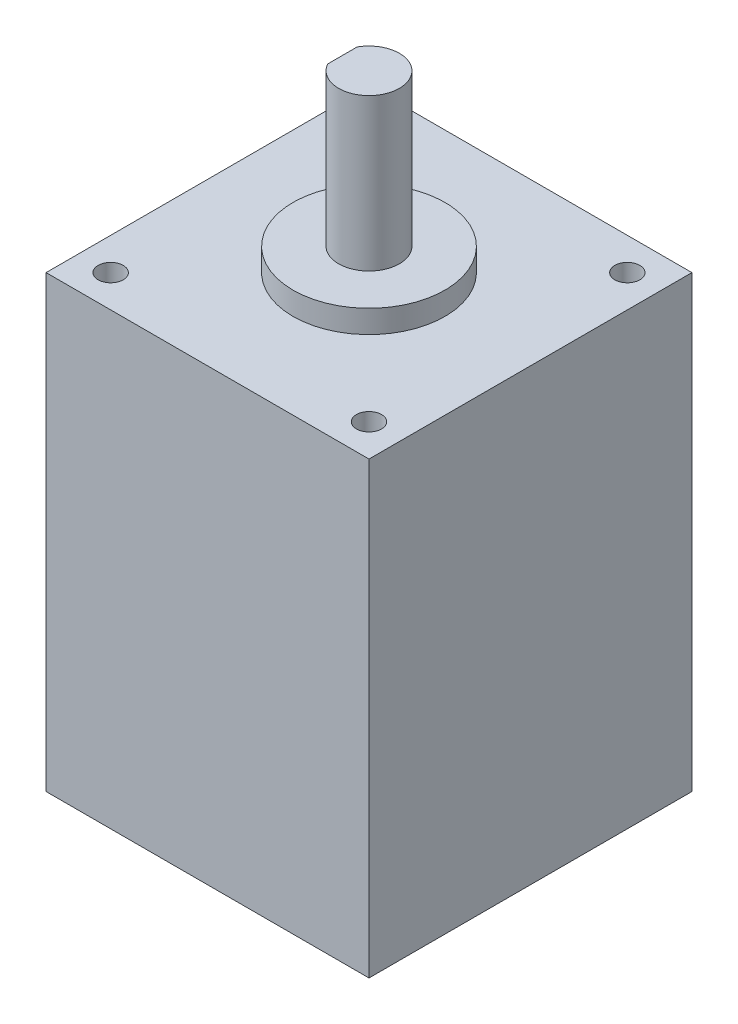
ISO-10303-21;
HEADER;
FILE_DESCRIPTION(('STEP AP214'),'2;1');
FILE_NAME('part.step','',(''),(''),'','','');
FILE_SCHEMA(('AUTOMOTIVE_DESIGN { 1 0 10303 214 1 1 1 1 }'));
ENDSEC;
DATA;
#1=APPLICATION_CONTEXT('core data for automotive mechanical design processes');
#2=APPLICATION_PROTOCOL_DEFINITION('international standard','automotive_design',2000,#1);
#3=PRODUCT_CONTEXT('',#1,'mechanical');
#4=PRODUCT('Part','Part','',(#3));
#5=PRODUCT_RELATED_PRODUCT_CATEGORY('part','',(#4));
#6=PRODUCT_DEFINITION_FORMATION('','',#4);
#7=PRODUCT_DEFINITION_CONTEXT('part definition',#1,'design');
#8=PRODUCT_DEFINITION('design','',#6,#7);
#9=PRODUCT_DEFINITION_SHAPE('','',#8);
#10=(LENGTH_UNIT() NAMED_UNIT(*) SI_UNIT(.MILLI.,.METRE.));
#11=(NAMED_UNIT(*) PLANE_ANGLE_UNIT() SI_UNIT($,.RADIAN.));
#12=(NAMED_UNIT(*) SI_UNIT($,.STERADIAN.) SOLID_ANGLE_UNIT());
#13=UNCERTAINTY_MEASURE_WITH_UNIT(LENGTH_MEASURE(1.E-05),#10,'distance_accuracy_value','');
#14=(GEOMETRIC_REPRESENTATION_CONTEXT(3) GLOBAL_UNCERTAINTY_ASSIGNED_CONTEXT((#13)) GLOBAL_UNIT_ASSIGNED_CONTEXT((#10,
#11,#12)) REPRESENTATION_CONTEXT('',''));
#15=CARTESIAN_POINT('',(0.,0.,0.));
#16=DIRECTION('',(0.,0.,1.));
#17=DIRECTION('',(1.,0.,0.));
#18=AXIS2_PLACEMENT_3D('',#15,#16,#17);
#19=CARTESIAN_POINT('',(0.,59.15,-42.5));
#20=DIRECTION('',(-1.,0.,0.));
#21=DIRECTION('',(0.,0.,1.));
#22=AXIS2_PLACEMENT_3D('',#19,#20,#21);
#23=PLANE('',#22);
#24=DIRECTION('',(0.,0.,-1.));
#25=VECTOR('',#24,1.);
#26=CARTESIAN_POINT('',(0.,0.,-42.5));
#27=LINE('',#26,#25);
#28=CARTESIAN_POINT('',(0.,0.,0.));
#29=VERTEX_POINT('',#28);
#30=CARTESIAN_POINT('',(0.,0.,-42.5));
#31=VERTEX_POINT('',#30);
#32=EDGE_CURVE('E164',#29,#31,#27,.T.);
#33=ORIENTED_EDGE('',*,*,#32,.T.);
#34=DIRECTION('',(0.,-1.,0.));
#35=VECTOR('',#34,1.);
#36=CARTESIAN_POINT('',(0.,59.15,-42.5));
#37=LINE('',#36,#35);
#38=CARTESIAN_POINT('',(0.,59.15,-42.5));
#39=VERTEX_POINT('',#38);
#40=EDGE_CURVE('E43',#39,#31,#37,.T.);
#41=ORIENTED_EDGE('',*,*,#40,.F.);
#42=DIRECTION('',(0.,0.,-1.));
#43=VECTOR('',#42,1.);
#44=CARTESIAN_POINT('',(0.,59.15,-42.5));
#45=LINE('',#44,#43);
#46=CARTESIAN_POINT('',(0.,59.15,0.));
#47=VERTEX_POINT('',#46);
#48=EDGE_CURVE('E167',#47,#39,#45,.T.);
#49=ORIENTED_EDGE('',*,*,#48,.F.);
#50=DIRECTION('',(0.,-1.,0.));
#51=VECTOR('',#50,1.);
#52=CARTESIAN_POINT('',(0.,59.15,0.));
#53=LINE('',#52,#51);
#54=EDGE_CURVE('E173',#47,#29,#53,.T.);
#55=ORIENTED_EDGE('',*,*,#54,.T.);
#56=EDGE_LOOP('',(#33,#41,#49,#55));
#57=FACE_BOUND('',#56,.T.);
#58=ADVANCED_FACE('F40',(#57),#23,.F.);
#59=CARTESIAN_POINT('',(-42.5,59.15,-42.5));
#60=DIRECTION('',(0.,0.,1.));
#61=DIRECTION('',(1.,0.,0.));
#62=AXIS2_PLACEMENT_3D('',#59,#60,#61);
#63=PLANE('',#62);
#64=DIRECTION('',(-1.,0.,0.));
#65=VECTOR('',#64,1.);
#66=CARTESIAN_POINT('',(-42.5,0.,-42.5));
#67=LINE('',#66,#65);
#68=CARTESIAN_POINT('',(-42.5,0.,-42.5));
#69=VERTEX_POINT('',#68);
#70=EDGE_CURVE('E176',#31,#69,#67,.T.);
#71=ORIENTED_EDGE('',*,*,#70,.T.);
#72=DIRECTION('',(0.,-1.,0.));
#73=VECTOR('',#72,1.);
#74=CARTESIAN_POINT('',(-42.5,59.15,-42.5));
#75=LINE('',#74,#73);
#76=CARTESIAN_POINT('',(-42.5,59.15,-42.5));
#77=VERTEX_POINT('',#76);
#78=EDGE_CURVE('E183',#77,#69,#75,.T.);
#79=ORIENTED_EDGE('',*,*,#78,.F.);
#80=DIRECTION('',(-1.,0.,0.));
#81=VECTOR('',#80,1.);
#82=CARTESIAN_POINT('',(-42.5,59.15,-42.5));
#83=LINE('',#82,#81);
#84=EDGE_CURVE('E94',#39,#77,#83,.T.);
#85=ORIENTED_EDGE('',*,*,#84,.F.);
#86=ORIENTED_EDGE('',*,*,#40,.T.);
#87=EDGE_LOOP('',(#71,#79,#85,#86));
#88=FACE_BOUND('',#87,.T.);
#89=ADVANCED_FACE('F189',(#88),#63,.F.);
#90=CARTESIAN_POINT('',(-42.5,59.15,0.));
#91=DIRECTION('',(1.,0.,0.));
#92=DIRECTION('',(0.,0.,-1.));
#93=AXIS2_PLACEMENT_3D('',#90,#91,#92);
#94=PLANE('',#93);
#95=DIRECTION('',(0.,0.,1.));
#96=VECTOR('',#95,1.);
#97=CARTESIAN_POINT('',(-42.5,0.,0.));
#98=LINE('',#97,#96);
#99=CARTESIAN_POINT('',(-42.5,0.,0.));
#100=VERTEX_POINT('',#99);
#101=EDGE_CURVE('E178',#69,#100,#98,.T.);
#102=ORIENTED_EDGE('',*,*,#101,.T.);
#103=DIRECTION('',(0.,-1.,0.));
#104=VECTOR('',#103,1.);
#105=CARTESIAN_POINT('',(-42.5,59.15,0.));
#106=LINE('',#105,#104);
#107=CARTESIAN_POINT('',(-42.5,59.15,0.));
#108=VERTEX_POINT('',#107);
#109=EDGE_CURVE('E182',#108,#100,#106,.T.);
#110=ORIENTED_EDGE('',*,*,#109,.F.);
#111=DIRECTION('',(0.,0.,1.));
#112=VECTOR('',#111,1.);
#113=CARTESIAN_POINT('',(-42.5,59.15,0.));
#114=LINE('',#113,#112);
#115=EDGE_CURVE('E170',#77,#108,#114,.T.);
#116=ORIENTED_EDGE('',*,*,#115,.F.);
#117=ORIENTED_EDGE('',*,*,#78,.T.);
#118=EDGE_LOOP('',(#102,#110,#116,#117));
#119=FACE_BOUND('',#118,.T.);
#120=ADVANCED_FACE('F196',(#119),#94,.F.);
#121=CARTESIAN_POINT('',(0.,59.15,0.));
#122=DIRECTION('',(0.,0.,-1.));
#123=DIRECTION('',(-1.,0.,0.));
#124=AXIS2_PLACEMENT_3D('',#121,#122,#123);
#125=PLANE('',#124);
#126=DIRECTION('',(1.,0.,0.));
#127=VECTOR('',#126,1.);
#128=CARTESIAN_POINT('',(0.,0.,0.));
#129=LINE('',#128,#127);
#130=EDGE_CURVE('E86',#100,#29,#129,.T.);
#131=ORIENTED_EDGE('',*,*,#130,.T.);
#132=ORIENTED_EDGE('',*,*,#54,.F.);
#133=DIRECTION('',(1.,0.,0.));
#134=VECTOR('',#133,1.);
#135=CARTESIAN_POINT('',(0.,59.15,0.));
#136=LINE('',#135,#134);
#137=EDGE_CURVE('E65',#108,#47,#136,.T.);
#138=ORIENTED_EDGE('',*,*,#137,.F.);
#139=ORIENTED_EDGE('',*,*,#109,.T.);
#140=EDGE_LOOP('',(#131,#132,#138,#139));
#141=FACE_BOUND('',#140,.T.);
#142=ADVANCED_FACE('F197',(#141),#125,.F.);
#143=CARTESIAN_POINT('',(0.,59.15,0.));
#144=DIRECTION('',(0.,-1.,0.));
#145=DIRECTION('',(0.,0.,-1.));
#146=AXIS2_PLACEMENT_3D('',#143,#144,#145);
#147=PLANE('',#146);
#148=CARTESIAN_POINT('',(-4.25,59.15,-38.25));
#149=DIRECTION('',(0.,1.,0.));
#150=DIRECTION('',(0.,0.,1.));
#151=AXIS2_PLACEMENT_3D('',#148,#149,#150);
#152=CIRCLE('',#151,1.65);
#153=CARTESIAN_POINT('',(-4.25,59.15,-36.6));
#154=VERTEX_POINT('',#153);
#155=EDGE_CURVE('E133',#154,#154,#152,.T.);
#156=ORIENTED_EDGE('',*,*,#155,.F.);
#157=EDGE_LOOP('',(#156));
#158=FACE_BOUND('',#157,.T.);
#159=CARTESIAN_POINT('',(-4.25,59.15,-4.25));
#160=DIRECTION('',(0.,1.,0.));
#161=DIRECTION('',(0.,0.,1.));
#162=AXIS2_PLACEMENT_3D('',#159,#160,#161);
#163=CIRCLE('',#162,1.65);
#164=CARTESIAN_POINT('',(-4.25,59.15,-2.6));
#165=VERTEX_POINT('',#164);
#166=EDGE_CURVE('E142',#165,#165,#163,.T.);
#167=ORIENTED_EDGE('',*,*,#166,.F.);
#168=EDGE_LOOP('',(#167));
#169=FACE_BOUND('',#168,.T.);
#170=CARTESIAN_POINT('',(-38.25,59.15,-4.25));
#171=DIRECTION('',(0.,1.,0.));
#172=DIRECTION('',(0.,0.,1.));
#173=AXIS2_PLACEMENT_3D('',#170,#171,#172);
#174=CIRCLE('',#173,1.65);
#175=CARTESIAN_POINT('',(-38.25,59.15,-2.6));
#176=VERTEX_POINT('',#175);
#177=EDGE_CURVE('E148',#176,#176,#174,.T.);
#178=ORIENTED_EDGE('',*,*,#177,.F.);
#179=EDGE_LOOP('',(#178));
#180=FACE_BOUND('',#179,.T.);
#181=CARTESIAN_POINT('',(-38.25,59.15,-38.25));
#182=DIRECTION('',(0.,1.,0.));
#183=DIRECTION('',(0.,0.,1.));
#184=AXIS2_PLACEMENT_3D('',#181,#182,#183);
#185=CIRCLE('',#184,1.65);
#186=CARTESIAN_POINT('',(-38.25,59.15,-36.6));
#187=VERTEX_POINT('',#186);
#188=EDGE_CURVE('E154',#187,#187,#185,.T.);
#189=ORIENTED_EDGE('',*,*,#188,.F.);
#190=EDGE_LOOP('',(#189));
#191=FACE_BOUND('',#190,.T.);
#192=CARTESIAN_POINT('',(-21.25,59.15,-21.25));
#193=DIRECTION('',(0.,1.,0.));
#194=DIRECTION('',(0.,0.,1.));
#195=AXIS2_PLACEMENT_3D('',#192,#193,#194);
#196=CIRCLE('',#195,10.);
#197=CARTESIAN_POINT('',(-21.25,59.15,-11.25));
#198=VERTEX_POINT('',#197);
#199=EDGE_CURVE('E48',#198,#198,#196,.T.);
#200=ORIENTED_EDGE('',*,*,#199,.F.);
#201=EDGE_LOOP('',(#200));
#202=FACE_BOUND('',#201,.T.);
#203=ORIENTED_EDGE('',*,*,#48,.T.);
#204=ORIENTED_EDGE('',*,*,#84,.T.);
#205=ORIENTED_EDGE('',*,*,#115,.T.);
#206=ORIENTED_EDGE('',*,*,#137,.T.);
#207=EDGE_LOOP('',(#203,#204,#205,#206));
#208=FACE_BOUND('',#207,.T.);
#209=ADVANCED_FACE('F198',(#158,#169,#180,#191,#202,#208),#147,.F.);
#210=CARTESIAN_POINT('',(0.,0.,0.));
#211=DIRECTION('',(0.,-1.,0.));
#212=DIRECTION('',(0.,0.,-1.));
#213=AXIS2_PLACEMENT_3D('',#210,#211,#212);
#214=PLANE('',#213);
#215=ORIENTED_EDGE('',*,*,#32,.F.);
#216=ORIENTED_EDGE('',*,*,#130,.F.);
#217=ORIENTED_EDGE('',*,*,#101,.F.);
#218=ORIENTED_EDGE('',*,*,#70,.F.);
#219=EDGE_LOOP('',(#215,#216,#217,#218));
#220=FACE_BOUND('',#219,.T.);
#221=ADVANCED_FACE('F194',(#220),#214,.T.);
#222=CARTESIAN_POINT('',(-21.25,62.15,-21.25));
#223=DIRECTION('',(0.,-1.,0.));
#224=DIRECTION('',(0.,0.,-1.));
#225=AXIS2_PLACEMENT_3D('',#222,#223,#224);
#226=CYLINDRICAL_SURFACE('',#225,10.);
#227=CARTESIAN_POINT('',(-21.25,62.15,-21.25));
#228=DIRECTION('',(0.,1.,0.));
#229=DIRECTION('',(0.,0.,1.));
#230=AXIS2_PLACEMENT_3D('',#227,#228,#229);
#231=CIRCLE('',#230,10.);
#232=CARTESIAN_POINT('',(-21.25,62.15,-11.25));
#233=VERTEX_POINT('',#232);
#234=EDGE_CURVE('E160',#233,#233,#231,.T.);
#235=ORIENTED_EDGE('',*,*,#234,.F.);
#236=EDGE_LOOP('',(#235));
#237=FACE_BOUND('',#236,.T.);
#238=ORIENTED_EDGE('',*,*,#199,.T.);
#239=EDGE_LOOP('',(#238));
#240=FACE_BOUND('',#239,.T.);
#241=ADVANCED_FACE('F206',(#237,#240),#226,.T.);
#242=CARTESIAN_POINT('',(-21.25,62.15,-21.25));
#243=DIRECTION('',(0.,1.,0.));
#244=DIRECTION('',(0.,0.,1.));
#245=AXIS2_PLACEMENT_3D('',#242,#243,#244);
#246=PLANE('',#245);
#247=CARTESIAN_POINT('',(-21.25,62.15,-21.25));
#248=DIRECTION('',(0.,1.,0.));
#249=DIRECTION('',(0.,0.,1.));
#250=AXIS2_PLACEMENT_3D('',#247,#248,#249);
#251=CIRCLE('',#250,4.);
#252=CARTESIAN_POINT('',(-21.25,62.15,-17.25));
#253=VERTEX_POINT('',#252);
#254=EDGE_CURVE('E11',#253,#253,#251,.T.);
#255=ORIENTED_EDGE('',*,*,#254,.F.);
#256=EDGE_LOOP('',(#255));
#257=FACE_BOUND('',#256,.T.);
#258=ORIENTED_EDGE('',*,*,#234,.T.);
#259=EDGE_LOOP('',(#258));
#260=FACE_BOUND('',#259,.T.);
#261=ADVANCED_FACE('F242',(#257,#260),#246,.T.);
#262=CARTESIAN_POINT('',(-21.25,82.15,-21.25));
#263=DIRECTION('',(0.,-1.,0.));
#264=DIRECTION('',(0.,0.,-1.));
#265=AXIS2_PLACEMENT_3D('',#262,#263,#264);
#266=CYLINDRICAL_SURFACE('',#265,4.);
#267=CARTESIAN_POINT('',(-21.25,82.15,-21.25));
#268=DIRECTION('',(0.,1.,0.));
#269=DIRECTION('',(0.,0.,1.));
#270=AXIS2_PLACEMENT_3D('',#267,#268,#269);
#271=CIRCLE('',#270,4.);
#272=CARTESIAN_POINT('',(-24.75,82.15,-19.3135083268963));
#273=VERTEX_POINT('',#272);
#274=CARTESIAN_POINT('',(-24.75,82.15,-23.1864916731037));
#275=VERTEX_POINT('',#274);
#276=EDGE_CURVE('E131',#273,#275,#271,.T.);
#277=ORIENTED_EDGE('',*,*,#276,.F.);
#278=DIRECTION('',(0.,1.,0.));
#279=VECTOR('',#278,1.);
#280=CARTESIAN_POINT('',(-24.75,70.15,-19.3135083268963));
#281=LINE('',#280,#279);
#282=CARTESIAN_POINT('',(-24.75,70.15,-19.3135083268963));
#283=VERTEX_POINT('',#282);
#284=EDGE_CURVE('E56',#283,#273,#281,.T.);
#285=ORIENTED_EDGE('',*,*,#284,.F.);
#286=CARTESIAN_POINT('',(-21.25,70.15,-21.25));
#287=DIRECTION('',(0.,1.,0.));
#288=DIRECTION('',(0.,0.,1.));
#289=AXIS2_PLACEMENT_3D('',#286,#287,#288);
#290=CIRCLE('',#289,4.);
#291=CARTESIAN_POINT('',(-24.75,70.15,-23.1864916731037));
#292=VERTEX_POINT('',#291);
#293=EDGE_CURVE('E117',#292,#283,#290,.T.);
#294=ORIENTED_EDGE('',*,*,#293,.F.);
#295=DIRECTION('',(0.,1.,0.));
#296=VECTOR('',#295,1.);
#297=CARTESIAN_POINT('',(-24.75,70.15,-23.1864916731037));
#298=LINE('',#297,#296);
#299=EDGE_CURVE('E125',#292,#275,#298,.T.);
#300=ORIENTED_EDGE('',*,*,#299,.T.);
#301=EDGE_LOOP('',(#277,#285,#294,#300));
#302=FACE_BOUND('',#301,.T.);
#303=ORIENTED_EDGE('',*,*,#254,.T.);
#304=EDGE_LOOP('',(#303));
#305=FACE_BOUND('',#304,.T.);
#306=ADVANCED_FACE('F128',(#302,#305),#266,.T.);
#307=CARTESIAN_POINT('',(-21.25,82.15,-21.25));
#308=DIRECTION('',(0.,1.,0.));
#309=DIRECTION('',(0.,0.,1.));
#310=AXIS2_PLACEMENT_3D('',#307,#308,#309);
#311=PLANE('',#310);
#312=DIRECTION('',(0.,0.,-1.));
#313=VECTOR('',#312,1.);
#314=CARTESIAN_POINT('',(-24.75,82.15,-19.3135083268963));
#315=LINE('',#314,#313);
#316=EDGE_CURVE('E122',#273,#275,#315,.T.);
#317=ORIENTED_EDGE('',*,*,#316,.F.);
#318=ORIENTED_EDGE('',*,*,#276,.T.);
#319=EDGE_LOOP('',(#317,#318));
#320=FACE_BOUND('',#319,.T.);
#321=ADVANCED_FACE('F273',(#320),#311,.T.);
#322=CARTESIAN_POINT('',(-38.25,47.65,-38.25));
#323=DIRECTION('',(0.,1.,0.));
#324=DIRECTION('',(0.,0.,1.));
#325=AXIS2_PLACEMENT_3D('',#322,#323,#324);
#326=CONICAL_SURFACE('',#325,1.65,1.02974425867665);
#327=CARTESIAN_POINT('',(-38.25,46.6585799786045,-38.25));
#328=VERTEX_POINT('',#327);
#329=VERTEX_LOOP('',#328);
#330=FACE_BOUND('',#329,.T.);
#331=CARTESIAN_POINT('',(-38.25,47.65,-38.25));
#332=DIRECTION('',(0.,1.,0.));
#333=DIRECTION('',(0.,0.,1.));
#334=AXIS2_PLACEMENT_3D('',#331,#332,#333);
#335=CIRCLE('',#334,1.65);
#336=CARTESIAN_POINT('',(-38.25,47.65,-36.6));
#337=VERTEX_POINT('',#336);
#338=EDGE_CURVE('E157',#337,#337,#335,.T.);
#339=ORIENTED_EDGE('',*,*,#338,.T.);
#340=EDGE_LOOP('',(#339));
#341=FACE_BOUND('',#340,.T.);
#342=ADVANCED_FACE('F267',(#330,#341),#326,.F.);
#343=CARTESIAN_POINT('',(-38.25,59.15,-38.25));
#344=DIRECTION('',(0.,1.,0.));
#345=DIRECTION('',(0.,0.,1.));
#346=AXIS2_PLACEMENT_3D('',#343,#344,#345);
#347=CYLINDRICAL_SURFACE('',#346,1.65);
#348=ORIENTED_EDGE('',*,*,#338,.F.);
#349=EDGE_LOOP('',(#348));
#350=FACE_BOUND('',#349,.T.);
#351=ORIENTED_EDGE('',*,*,#188,.T.);
#352=EDGE_LOOP('',(#351));
#353=FACE_BOUND('',#352,.T.);
#354=ADVANCED_FACE('F272',(#350,#353),#347,.F.);
#355=CARTESIAN_POINT('',(-38.25,47.65,-4.25));
#356=DIRECTION('',(0.,1.,0.));
#357=DIRECTION('',(0.,0.,1.));
#358=AXIS2_PLACEMENT_3D('',#355,#356,#357);
#359=CONICAL_SURFACE('',#358,1.65,1.02974425867665);
#360=CARTESIAN_POINT('',(-38.25,46.6585799786045,-4.25));
#361=VERTEX_POINT('',#360);
#362=VERTEX_LOOP('',#361);
#363=FACE_BOUND('',#362,.T.);
#364=CARTESIAN_POINT('',(-38.25,47.65,-4.25));
#365=DIRECTION('',(0.,1.,0.));
#366=DIRECTION('',(0.,0.,1.));
#367=AXIS2_PLACEMENT_3D('',#364,#365,#366);
#368=CIRCLE('',#367,1.65);
#369=CARTESIAN_POINT('',(-38.25,47.65,-2.6));
#370=VERTEX_POINT('',#369);
#371=EDGE_CURVE('E151',#370,#370,#368,.T.);
#372=ORIENTED_EDGE('',*,*,#371,.T.);
#373=EDGE_LOOP('',(#372));
#374=FACE_BOUND('',#373,.T.);
#375=ADVANCED_FACE('F286',(#363,#374),#359,.F.);
#376=CARTESIAN_POINT('',(-38.25,59.15,-4.25));
#377=DIRECTION('',(0.,1.,0.));
#378=DIRECTION('',(0.,0.,1.));
#379=AXIS2_PLACEMENT_3D('',#376,#377,#378);
#380=CYLINDRICAL_SURFACE('',#379,1.65);
#381=ORIENTED_EDGE('',*,*,#371,.F.);
#382=EDGE_LOOP('',(#381));
#383=FACE_BOUND('',#382,.T.);
#384=ORIENTED_EDGE('',*,*,#177,.T.);
#385=EDGE_LOOP('',(#384));
#386=FACE_BOUND('',#385,.T.);
#387=ADVANCED_FACE('F298',(#383,#386),#380,.F.);
#388=CARTESIAN_POINT('',(-4.25,47.65,-4.25));
#389=DIRECTION('',(0.,1.,0.));
#390=DIRECTION('',(0.,0.,1.));
#391=AXIS2_PLACEMENT_3D('',#388,#389,#390);
#392=CONICAL_SURFACE('',#391,1.65,1.02974425867665);
#393=CARTESIAN_POINT('',(-4.25,46.6585799786045,-4.25));
#394=VERTEX_POINT('',#393);
#395=VERTEX_LOOP('',#394);
#396=FACE_BOUND('',#395,.T.);
#397=CARTESIAN_POINT('',(-4.25,47.65,-4.25));
#398=DIRECTION('',(0.,1.,0.));
#399=DIRECTION('',(0.,0.,1.));
#400=AXIS2_PLACEMENT_3D('',#397,#398,#399);
#401=CIRCLE('',#400,1.65);
#402=CARTESIAN_POINT('',(-4.25,47.65,-2.6));
#403=VERTEX_POINT('',#402);
#404=EDGE_CURVE('E145',#403,#403,#401,.T.);
#405=ORIENTED_EDGE('',*,*,#404,.T.);
#406=EDGE_LOOP('',(#405));
#407=FACE_BOUND('',#406,.T.);
#408=ADVANCED_FACE('F308',(#396,#407),#392,.F.);
#409=CARTESIAN_POINT('',(-4.25,59.15,-4.25));
#410=DIRECTION('',(0.,1.,0.));
#411=DIRECTION('',(0.,0.,1.));
#412=AXIS2_PLACEMENT_3D('',#409,#410,#411);
#413=CYLINDRICAL_SURFACE('',#412,1.65);
#414=ORIENTED_EDGE('',*,*,#404,.F.);
#415=EDGE_LOOP('',(#414));
#416=FACE_BOUND('',#415,.T.);
#417=ORIENTED_EDGE('',*,*,#166,.T.);
#418=EDGE_LOOP('',(#417));
#419=FACE_BOUND('',#418,.T.);
#420=ADVANCED_FACE('F319',(#416,#419),#413,.F.);
#421=CARTESIAN_POINT('',(-4.25,47.65,-38.25));
#422=DIRECTION('',(0.,1.,0.));
#423=DIRECTION('',(0.,0.,1.));
#424=AXIS2_PLACEMENT_3D('',#421,#422,#423);
#425=CONICAL_SURFACE('',#424,1.65,1.02974425867665);
#426=CARTESIAN_POINT('',(-4.25,46.6585799786045,-38.25));
#427=VERTEX_POINT('',#426);
#428=VERTEX_LOOP('',#427);
#429=FACE_BOUND('',#428,.T.);
#430=CARTESIAN_POINT('',(-4.25,47.65,-38.25));
#431=DIRECTION('',(0.,1.,0.));
#432=DIRECTION('',(0.,0.,1.));
#433=AXIS2_PLACEMENT_3D('',#430,#431,#432);
#434=CIRCLE('',#433,1.65);
#435=CARTESIAN_POINT('',(-4.25,47.65,-36.6));
#436=VERTEX_POINT('',#435);
#437=EDGE_CURVE('E139',#436,#436,#434,.T.);
#438=ORIENTED_EDGE('',*,*,#437,.T.);
#439=EDGE_LOOP('',(#438));
#440=FACE_BOUND('',#439,.T.);
#441=ADVANCED_FACE('F329',(#429,#440),#425,.F.);
#442=CARTESIAN_POINT('',(-4.25,59.15,-38.25));
#443=DIRECTION('',(0.,1.,0.));
#444=DIRECTION('',(0.,0.,1.));
#445=AXIS2_PLACEMENT_3D('',#442,#443,#444);
#446=CYLINDRICAL_SURFACE('',#445,1.65);
#447=ORIENTED_EDGE('',*,*,#437,.F.);
#448=EDGE_LOOP('',(#447));
#449=FACE_BOUND('',#448,.T.);
#450=ORIENTED_EDGE('',*,*,#155,.T.);
#451=EDGE_LOOP('',(#450));
#452=FACE_BOUND('',#451,.T.);
#453=ADVANCED_FACE('F341',(#449,#452),#446,.F.);
#454=CARTESIAN_POINT('',(-24.75,70.15,-19.3135083268963));
#455=DIRECTION('',(1.,0.,0.));
#456=DIRECTION('',(0.,0.,-1.));
#457=AXIS2_PLACEMENT_3D('',#454,#455,#456);
#458=PLANE('',#457);
#459=ORIENTED_EDGE('',*,*,#316,.T.);
#460=ORIENTED_EDGE('',*,*,#299,.F.);
#461=DIRECTION('',(0.,0.,-1.));
#462=VECTOR('',#461,1.);
#463=CARTESIAN_POINT('',(-24.75,70.15,-19.3135083268963));
#464=LINE('',#463,#462);
#465=EDGE_CURVE('E119',#283,#292,#464,.T.);
#466=ORIENTED_EDGE('',*,*,#465,.F.);
#467=ORIENTED_EDGE('',*,*,#284,.T.);
#468=EDGE_LOOP('',(#459,#460,#466,#467));
#469=FACE_BOUND('',#468,.T.);
#470=ADVANCED_FACE('F124',(#469),#458,.F.);
#471=CARTESIAN_POINT('',(-21.25,70.15,-21.25));
#472=DIRECTION('',(0.,1.,0.));
#473=DIRECTION('',(0.,0.,1.));
#474=AXIS2_PLACEMENT_3D('',#471,#472,#473);
#475=PLANE('',#474);
#476=ORIENTED_EDGE('',*,*,#293,.T.);
#477=ORIENTED_EDGE('',*,*,#465,.T.);
#478=EDGE_LOOP('',(#476,#477));
#479=FACE_BOUND('',#478,.T.);
#480=ADVANCED_FACE('F118',(#479),#475,.T.);
#481=CLOSED_SHELL('',(#58,#89,#120,#142,#209,#221,#241,#261,#306,#321,#342,#354,#375,#387,#408,
#420,#441,#453,#470,#480));
#482=MANIFOLD_SOLID_BREP('B2',#481);
#483=ADVANCED_BREP_SHAPE_REPRESENTATION('',(#18,#482),#14);
#484=SHAPE_DEFINITION_REPRESENTATION(#9,#483);
ENDSEC;
END-ISO-10303-21;
